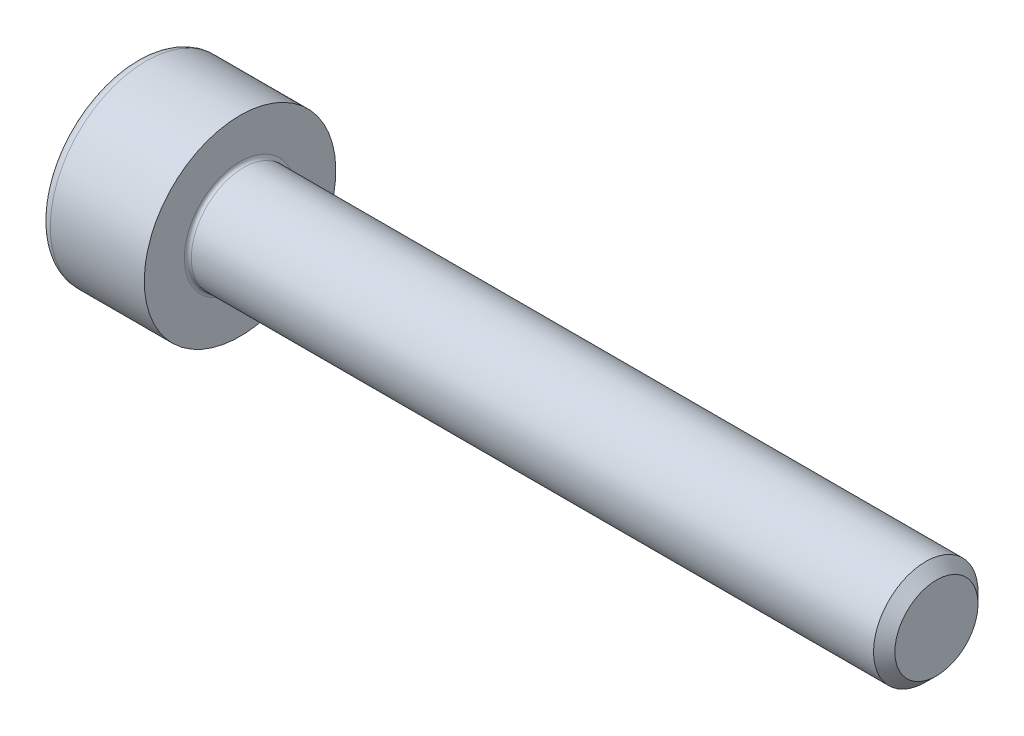
ISO-10303-21;
HEADER;
FILE_DESCRIPTION(('STEP AP214'),'2;1');
FILE_NAME('part.step','',(''),(''),'','','');
FILE_SCHEMA(('AUTOMOTIVE_DESIGN { 1 0 10303 214 1 1 1 1 }'));
ENDSEC;
DATA;
#1=APPLICATION_CONTEXT('core data for automotive mechanical design processes');
#2=APPLICATION_PROTOCOL_DEFINITION('international standard','automotive_design',2000,#1);
#3=PRODUCT_CONTEXT('',#1,'mechanical');
#4=PRODUCT('Part','Part','',(#3));
#5=PRODUCT_RELATED_PRODUCT_CATEGORY('part','',(#4));
#6=PRODUCT_DEFINITION_FORMATION('','',#4);
#7=PRODUCT_DEFINITION_CONTEXT('part definition',#1,'design');
#8=PRODUCT_DEFINITION('design','',#6,#7);
#9=PRODUCT_DEFINITION_SHAPE('','',#8);
#10=(LENGTH_UNIT() NAMED_UNIT(*) SI_UNIT(.MILLI.,.METRE.));
#11=(NAMED_UNIT(*) PLANE_ANGLE_UNIT() SI_UNIT($,.RADIAN.));
#12=(NAMED_UNIT(*) SI_UNIT($,.STERADIAN.) SOLID_ANGLE_UNIT());
#13=UNCERTAINTY_MEASURE_WITH_UNIT(LENGTH_MEASURE(1.E-05),#10,'distance_accuracy_value','');
#14=(GEOMETRIC_REPRESENTATION_CONTEXT(3) GLOBAL_UNCERTAINTY_ASSIGNED_CONTEXT((#13)) GLOBAL_UNIT_ASSIGNED_CONTEXT((#10,
#11,#12)) REPRESENTATION_CONTEXT('',''));
#15=CARTESIAN_POINT('',(0.,0.,0.));
#16=DIRECTION('',(0.,0.,1.));
#17=DIRECTION('',(1.,0.,0.));
#18=AXIS2_PLACEMENT_3D('',#15,#16,#17);
#19=CARTESIAN_POINT('',(-1.70499999995855,0.,0.));
#20=DIRECTION('',(-1.,0.,0.));
#21=DIRECTION('',(0.,0.,1.));
#22=AXIS2_PLACEMENT_3D('',#19,#20,#21);
#23=CONICAL_SURFACE('',#22,1.45203592694543,1.04719755118368);
#24=CARTESIAN_POINT('',(-0.866666666638594,0.,0.));
#25=VERTEX_POINT('',#24);
#26=VERTEX_LOOP('',#25);
#27=FACE_BOUND('',#26,.T.);
#28=CARTESIAN_POINT('',(-1.69999999999703,1.25,0.721687836487888));
#29=CARTESIAN_POINT('',(-1.68168471570057,1.25,0.658260217058919));
#30=CARTESIAN_POINT('',(-1.66502792318348,1.25,0.594285091321345));
#31=CARTESIAN_POINT('',(-1.63595399212002,1.25,0.46522715333814));
#32=CARTESIAN_POINT('',(-1.62354713770574,1.25,0.400142048729171));
#33=CARTESIAN_POINT('',(-1.60423497433511,1.25,0.270778406586236));
#34=CARTESIAN_POINT('',(-1.59720111724166,1.25,0.206519767731085));
#35=CARTESIAN_POINT('',(-1.58880573007492,1.25,0.0777002896402734));
#36=CARTESIAN_POINT('',(-1.58743724622727,1.25,0.0131399183071135));
#37=CARTESIAN_POINT('',(-1.59029143134034,1.25,-0.107484209658902));
#38=CARTESIAN_POINT('',(-1.59381330325391,1.25,-0.16356606692486));
#39=CARTESIAN_POINT('',(-1.604973312943,1.25,-0.275364426450217));
#40=CARTESIAN_POINT('',(-1.61261525922482,1.25,-0.331080542317558));
#41=CARTESIAN_POINT('',(-1.63171864583147,1.25,-0.443109217006952));
#42=CARTESIAN_POINT('',(-1.64326102638181,1.25,-0.499407604241041));
#43=CARTESIAN_POINT('',(-1.66945735052075,1.25,-0.611164931122247));
#44=CARTESIAN_POINT('',(-1.68410514296671,1.25,-0.666625301405443));
#45=CARTESIAN_POINT('',(-1.69999999999703,1.25,-0.72168783648789));
#46=B_SPLINE_CURVE_WITH_KNOTS('',3,(#28,#29,#30,#31,#32,#33,#34,#35,#36,#37,#38,#39,#40,#41,#42,
#43,#44,#45),.UNSPECIFIED.,.F.,.F.,(4,2,2,2,2,2,2,2,4),(0.,0.198135007224076,0.396746135644064,
0.590442253848449,0.783900555564741,0.952317364148294,1.12089012112463,1.29320101405853,
1.46517373344992),.UNSPECIFIED.);
#47=CARTESIAN_POINT('',(-1.69999999999703,1.25000000000037,0.721687836487247));
#48=VERTEX_POINT('',#47);
#49=CARTESIAN_POINT('',(-1.6999999999969,1.25,-0.721687836487461));
#50=VERTEX_POINT('',#49);
#51=EDGE_CURVE('E20',#48,#50,#46,.T.);
#52=ORIENTED_EDGE('',*,*,#51,.T.);
#53=CARTESIAN_POINT('',(-1.69999999999703,1.25000000000074,-0.721687836486606));
#54=CARTESIAN_POINT('',(-1.68168471570057,1.19507007027368,-0.753401646201091));
#55=CARTESIAN_POINT('',(-1.66502792318348,1.13966598617464,-0.785389209069878));
#56=CARTESIAN_POINT('',(-1.63595399212002,1.02789853332115,-0.84991817806148));
#57=CARTESIAN_POINT('',(-1.62354713770574,0.971533179321811,-0.882460730365965));
#58=CARTESIAN_POINT('',(-1.60423497433511,0.85950097889995,-0.947142551437432));
#59=CARTESIAN_POINT('',(-1.59720111724167,0.80385136523878,-0.979271870865007));
#60=CARTESIAN_POINT('',(-1.58880573007492,0.692290424709884,-1.04368160991041));
#61=CARTESIAN_POINT('',(-1.58743724622727,0.636379503057611,-1.07596179557699));
#62=CARTESIAN_POINT('',(-1.59029143134034,0.531915943929697,-1.13627385956));
#63=CARTESIAN_POINT('',(-1.59381330325391,0.483347630845964,-1.16431478819298));
#64=CARTESIAN_POINT('',(-1.604973312943,0.386527411395579,-1.22021396795566));
#65=CARTESIAN_POINT('',(-1.61261525922482,0.338275839654265,-1.24807202588933));
#66=CARTESIAN_POINT('',(-1.63171864583147,0.241256161420947,-1.30408636323403));
#67=CARTESIAN_POINT('',(-1.64326102638182,0.192500327884133,-1.33223555685107));
#68=CARTESIAN_POINT('',(-1.66945735052075,0.0957156437459675,-1.38811422029167));
#69=CARTESIAN_POINT('',(-1.68410514296671,0.0476855541774276,-1.41584440543327));
#70=CARTESIAN_POINT('',(-1.69999999999703,-7.42934727826491E-13,-1.44337567297449));
#71=B_SPLINE_CURVE_WITH_KNOTS('',3,(#53,#54,#55,#56,#57,#58,#59,#60,#61,#62,#63,#64,#65,#66,#67,
#68,#69,#70),.UNSPECIFIED.,.F.,.F.,(4,2,2,2,2,2,2,2,4),(0.,0.198135007224076,0.396746135644064,
0.590442253848448,0.783900555564741,0.952317364148293,1.12089012112463,1.29320101405852,
1.46517373344991),.UNSPECIFIED.);
#72=CARTESIAN_POINT('',(-1.69999999999703,0.,-1.4433756729745));
#73=VERTEX_POINT('',#72);
#74=EDGE_CURVE('E81',#50,#73,#71,.T.);
#75=ORIENTED_EDGE('',*,*,#74,.T.);
#76=CARTESIAN_POINT('',(-1.69999999999703,7.37971043012133E-13,-1.4433756729745));
#77=CARTESIAN_POINT('',(-1.68168471570057,-0.0549299297263209,-1.41166186326001));
#78=CARTESIAN_POINT('',(-1.66502792318348,-0.110334013825364,-1.37967430039122));
#79=CARTESIAN_POINT('',(-1.63595399212002,-0.222101466678856,-1.31514533139962));
#80=CARTESIAN_POINT('',(-1.62354713770574,-0.278466820678191,-1.28260277909514));
#81=CARTESIAN_POINT('',(-1.60423497433511,-0.390499021100053,-1.21792095802367));
#82=CARTESIAN_POINT('',(-1.59720111724167,-0.446148634761223,-1.18579163859609));
#83=CARTESIAN_POINT('',(-1.58880573007492,-0.557709575290119,-1.12138189955069));
#84=CARTESIAN_POINT('',(-1.58743724622727,-0.613620496942393,-1.08910171388411));
#85=CARTESIAN_POINT('',(-1.59029143134035,-0.718084056070307,-1.0287896499011));
#86=CARTESIAN_POINT('',(-1.59381330325391,-0.766652369154039,-1.00074872126812));
#87=CARTESIAN_POINT('',(-1.604973312943,-0.863472588604424,-0.944849541505444));
#88=CARTESIAN_POINT('',(-1.61261525922483,-0.911724160345738,-0.916991483571773));
#89=CARTESIAN_POINT('',(-1.63171864583147,-1.00874383857905,-0.860977146227077));
#90=CARTESIAN_POINT('',(-1.64326102638182,-1.05749967211587,-0.832827952610033));
#91=CARTESIAN_POINT('',(-1.66945735052075,-1.15428435625403,-0.776949289169431));
#92=CARTESIAN_POINT('',(-1.68410514296671,-1.20231444582257,-0.749219104027832));
#93=CARTESIAN_POINT('',(-1.69999999999703,-1.25000000000074,-0.721687836486609));
#94=B_SPLINE_CURVE_WITH_KNOTS('',3,(#76,#77,#78,#79,#80,#81,#82,#83,#84,#85,#86,#87,#88,#89,#90,
#91,#92,#93),.UNSPECIFIED.,.F.,.F.,(4,2,2,2,2,2,2,2,4),(0.,0.198135007224076,0.396746135644065,
0.59044225384845,0.783900555564743,0.952317364148295,1.12089012112463,1.29320101405852,
1.46517373344991),.UNSPECIFIED.);
#95=CARTESIAN_POINT('',(-1.69999999999703,-1.25000000000037,-0.72168783648725));
#96=VERTEX_POINT('',#95);
#97=EDGE_CURVE('E107',#73,#96,#94,.T.);
#98=ORIENTED_EDGE('',*,*,#97,.T.);
#99=CARTESIAN_POINT('',(-1.69999999999703,-1.25,-0.72168783648789));
#100=CARTESIAN_POINT('',(-1.68168471570057,-1.25,-0.658260217058921));
#101=CARTESIAN_POINT('',(-1.66502792318348,-1.25,-0.594285091321346));
#102=CARTESIAN_POINT('',(-1.63595399212002,-1.25,-0.465227153338142));
#103=CARTESIAN_POINT('',(-1.62354713770574,-1.25,-0.400142048729173));
#104=CARTESIAN_POINT('',(-1.60423497433511,-1.25,-0.270778406586237));
#105=CARTESIAN_POINT('',(-1.59720111724167,-1.25,-0.206519767731087));
#106=CARTESIAN_POINT('',(-1.58880573007492,-1.25,-0.0777002896402751));
#107=CARTESIAN_POINT('',(-1.58743724622727,-1.25,-0.0131399183071152));
#108=CARTESIAN_POINT('',(-1.59029143134034,-1.25,0.1074842096589));
#109=CARTESIAN_POINT('',(-1.59381330325391,-1.25,0.163566066924858));
#110=CARTESIAN_POINT('',(-1.604973312943,-1.25,0.275364426450216));
#111=CARTESIAN_POINT('',(-1.61261525922482,-1.25,0.331080542317556));
#112=CARTESIAN_POINT('',(-1.63171864583147,-1.25,0.44310921700695));
#113=CARTESIAN_POINT('',(-1.64326102638181,-1.25,0.499407604241038));
#114=CARTESIAN_POINT('',(-1.66945735052075,-1.25,0.611164931122244));
#115=CARTESIAN_POINT('',(-1.68410514296671,-1.25,0.666625301405441));
#116=CARTESIAN_POINT('',(-1.69999999999703,-1.25,0.721687836487888));
#117=B_SPLINE_CURVE_WITH_KNOTS('',3,(#99,#100,#101,#102,#103,#104,#105,#106,#107,#108,#109,#110,
#111,#112,#113,#114,#115,#116),.UNSPECIFIED.,.F.,.F.,(4,2,2,2,2,2,2,2,4),(0.,0.198135007224076,
0.396746135644065,0.590442253848449,0.783900555564742,0.952317364148295,1.12089012112463,
1.29320101405853,1.46517373344992),.UNSPECIFIED.);
#118=CARTESIAN_POINT('',(-1.69999999999703,-1.25000000000037,0.721687836487246));
#119=VERTEX_POINT('',#118);
#120=EDGE_CURVE('E132',#96,#119,#117,.T.);
#121=ORIENTED_EDGE('',*,*,#120,.T.);
#122=CARTESIAN_POINT('',(-1.69999999999703,-1.25000000000074,0.721687836486605));
#123=CARTESIAN_POINT('',(-1.68168471570057,-1.19507007027368,0.75340164620109));
#124=CARTESIAN_POINT('',(-1.66502792318348,-1.13966598617464,0.785389209069877));
#125=CARTESIAN_POINT('',(-1.63595399212002,-1.02789853332115,0.849918178061479));
#126=CARTESIAN_POINT('',(-1.62354713770574,-0.971533179321813,0.882460730365964));
#127=CARTESIAN_POINT('',(-1.60423497433511,-0.859500978899952,0.947142551437431));
#128=CARTESIAN_POINT('',(-1.59720111724167,-0.803851365238782,0.979271870865006));
#129=CARTESIAN_POINT('',(-1.58880573007492,-0.692290424709886,1.04368160991041));
#130=CARTESIAN_POINT('',(-1.58743724622727,-0.636379503057612,1.07596179557699));
#131=CARTESIAN_POINT('',(-1.59029143134034,-0.531915943929698,1.13627385956));
#132=CARTESIAN_POINT('',(-1.59381330325391,-0.483347630845966,1.16431478819298));
#133=CARTESIAN_POINT('',(-1.604973312943,-0.38652741139558,1.22021396795566));
#134=CARTESIAN_POINT('',(-1.61261525922482,-0.338275839654266,1.24807202588933));
#135=CARTESIAN_POINT('',(-1.63171864583147,-0.241256161420948,1.30408636323402));
#136=CARTESIAN_POINT('',(-1.64326102638182,-0.192500327884134,1.33223555685107));
#137=CARTESIAN_POINT('',(-1.66945735052075,-0.095715643745968,1.38811422029167));
#138=CARTESIAN_POINT('',(-1.68410514296671,-0.0476855541774282,1.41584440543327));
#139=CARTESIAN_POINT('',(-1.69999999999703,7.42500278451778E-13,1.44337567297449));
#140=B_SPLINE_CURVE_WITH_KNOTS('',3,(#122,#123,#124,#125,#126,#127,#128,#129,#130,#131,#132,
#133,#134,#135,#136,#137,#138,#139),.UNSPECIFIED.,.F.,.F.,(4,2,2,2,2,2,2,2,4),(0.,
0.198135007224075,0.396746135644065,0.590442253848449,0.783900555564742,0.952317364148295,
1.12089012112463,1.29320101405853,1.46517373344992),.UNSPECIFIED.);
#141=CARTESIAN_POINT('',(-1.69999999999703,0.,1.4433756729745));
#142=VERTEX_POINT('',#141);
#143=EDGE_CURVE('E141',#119,#142,#140,.T.);
#144=ORIENTED_EDGE('',*,*,#143,.T.);
#145=CARTESIAN_POINT('',(-1.69999999999703,-7.38806721613336E-13,1.4433756729745));
#146=CARTESIAN_POINT('',(-1.68168471570057,0.0549299297263202,1.41166186326001));
#147=CARTESIAN_POINT('',(-1.66502792318348,0.110334013825363,1.37967430039122));
#148=CARTESIAN_POINT('',(-1.63595399212002,0.222101466678855,1.31514533139962));
#149=CARTESIAN_POINT('',(-1.62354713770574,0.27846682067819,1.28260277909514));
#150=CARTESIAN_POINT('',(-1.60423497433511,0.390499021100052,1.21792095802367));
#151=CARTESIAN_POINT('',(-1.59720111724167,0.446148634761222,1.18579163859609));
#152=CARTESIAN_POINT('',(-1.58880573007492,0.557709575290118,1.12138189955069));
#153=CARTESIAN_POINT('',(-1.58743724622727,0.613620496942391,1.08910171388411));
#154=CARTESIAN_POINT('',(-1.59029143134034,0.718084056070306,1.0287896499011));
#155=CARTESIAN_POINT('',(-1.59381330325391,0.766652369154038,1.00074872126812));
#156=CARTESIAN_POINT('',(-1.604973312943,0.863472588604423,0.944849541505442));
#157=CARTESIAN_POINT('',(-1.61261525922482,0.911724160345737,0.916991483571772));
#158=CARTESIAN_POINT('',(-1.63171864583147,1.00874383857905,0.860977146227076));
#159=CARTESIAN_POINT('',(-1.64326102638182,1.05749967211587,0.832827952610031));
#160=CARTESIAN_POINT('',(-1.66945735052075,1.15428435625403,0.776949289169429));
#161=CARTESIAN_POINT('',(-1.68410514296671,1.20231444582257,0.74921910402783));
#162=CARTESIAN_POINT('',(-1.69999999999703,1.25000000000074,0.721687836486607));
#163=B_SPLINE_CURVE_WITH_KNOTS('',3,(#145,#146,#147,#148,#149,#150,#151,#152,#153,#154,#155,
#156,#157,#158,#159,#160,#161,#162),.UNSPECIFIED.,.F.,.F.,(4,2,2,2,2,2,2,2,4),(0.,
0.198135007224076,0.396746135644066,0.59044225384845,0.783900555564744,0.952317364148296,
1.12089012112463,1.29320101405853,1.46517373344991),.UNSPECIFIED.);
#164=EDGE_CURVE('E83',#142,#48,#163,.T.);
#165=ORIENTED_EDGE('',*,*,#164,.T.);
#166=EDGE_LOOP('',(#52,#75,#98,#121,#144,#165));
#167=FACE_BOUND('',#166,.T.);
#168=ADVANCED_FACE('F16',(#27,#167),#23,.F.);
#169=CARTESIAN_POINT('',(-2.99999999999999,1.25,0.721687836487031));
#170=DIRECTION('',(0.,1.,0.));
#171=DIRECTION('',(0.,0.,1.));
#172=AXIS2_PLACEMENT_3D('',#169,#170,#171);
#173=PLANE('',#172);
#174=DIRECTION('',(1.,0.,0.));
#175=VECTOR('',#174,1.);
#176=CARTESIAN_POINT('',(-2.99999999999999,1.25,0.721687836487034));
#177=LINE('',#176,#175);
#178=CARTESIAN_POINT('',(-2.99999999999999,1.25,0.721687836487032));
#179=VERTEX_POINT('',#178);
#180=EDGE_CURVE('E85',#48,#179,#177,.F.);
#181=ORIENTED_EDGE('',*,*,#180,.T.);
#182=DIRECTION('',(0.,0.,1.));
#183=VECTOR('',#182,1.);
#184=CARTESIAN_POINT('',(-2.99999999999999,1.25,0.));
#185=LINE('',#184,#183);
#186=CARTESIAN_POINT('',(-2.99999999999999,1.25,-0.721687836487033));
#187=VERTEX_POINT('',#186);
#188=EDGE_CURVE('E90',#187,#179,#185,.T.);
#189=ORIENTED_EDGE('',*,*,#188,.F.);
#190=DIRECTION('',(1.,0.,0.));
#191=VECTOR('',#190,1.);
#192=CARTESIAN_POINT('',(-2.99999999999999,1.25,-0.721687836487033));
#193=LINE('',#192,#191);
#194=EDGE_CURVE('E88',#187,#50,#193,.T.);
#195=ORIENTED_EDGE('',*,*,#194,.T.);
#196=ORIENTED_EDGE('',*,*,#51,.F.);
#197=EDGE_LOOP('',(#181,#189,#195,#196));
#198=FACE_BOUND('',#197,.T.);
#199=ADVANCED_FACE('F77',(#198),#173,.F.);
#200=CARTESIAN_POINT('',(-2.99999999999999,0.,1.44337567297407));
#201=DIRECTION('',(0.,0.500000000000001,0.866025403784438));
#202=DIRECTION('',(0.,-0.866025403784438,0.500000000000001));
#203=AXIS2_PLACEMENT_3D('',#200,#201,#202);
#204=PLANE('',#203);
#205=DIRECTION('',(1.,0.,0.));
#206=VECTOR('',#205,1.);
#207=CARTESIAN_POINT('',(-2.99999999999999,0.,1.44337567297407));
#208=LINE('',#207,#206);
#209=CARTESIAN_POINT('',(-2.99999999999999,0.,1.44337567297407));
#210=VERTEX_POINT('',#209);
#211=EDGE_CURVE('E146',#142,#210,#208,.F.);
#212=ORIENTED_EDGE('',*,*,#211,.T.);
#213=DIRECTION('',(0.,-0.866025403784437,0.500000000000004));
#214=VECTOR('',#213,1.);
#215=CARTESIAN_POINT('',(-2.99999999999999,1.25,0.721687836487031));
#216=LINE('',#215,#214);
#217=EDGE_CURVE('E96',#179,#210,#216,.T.);
#218=ORIENTED_EDGE('',*,*,#217,.F.);
#219=ORIENTED_EDGE('',*,*,#180,.F.);
#220=ORIENTED_EDGE('',*,*,#164,.F.);
#221=EDGE_LOOP('',(#212,#218,#219,#220));
#222=FACE_BOUND('',#221,.T.);
#223=ADVANCED_FACE('F151',(#222),#204,.F.);
#224=CARTESIAN_POINT('',(-2.99999999999999,-1.25,0.721687836487033));
#225=DIRECTION('',(0.,-0.5,0.866025403784439));
#226=DIRECTION('',(0.,-0.866025403784439,-0.5));
#227=AXIS2_PLACEMENT_3D('',#224,#225,#226);
#228=PLANE('',#227);
#229=DIRECTION('',(1.,0.,0.));
#230=VECTOR('',#229,1.);
#231=CARTESIAN_POINT('',(-2.99999999999999,-1.25,0.721687836487032));
#232=LINE('',#231,#230);
#233=CARTESIAN_POINT('',(-2.99999999999999,-1.25,0.721687836487032));
#234=VERTEX_POINT('',#233);
#235=EDGE_CURVE('E140',#119,#234,#232,.F.);
#236=ORIENTED_EDGE('',*,*,#235,.T.);
#237=DIRECTION('',(0.,-0.866025403784437,-0.500000000000003));
#238=VECTOR('',#237,1.);
#239=CARTESIAN_POINT('',(-2.99999999999999,0.,1.44337567297407));
#240=LINE('',#239,#238);
#241=EDGE_CURVE('E270',#210,#234,#240,.T.);
#242=ORIENTED_EDGE('',*,*,#241,.F.);
#243=ORIENTED_EDGE('',*,*,#211,.F.);
#244=ORIENTED_EDGE('',*,*,#143,.F.);
#245=EDGE_LOOP('',(#236,#242,#243,#244));
#246=FACE_BOUND('',#245,.T.);
#247=ADVANCED_FACE('F128',(#246),#228,.F.);
#248=CARTESIAN_POINT('',(-2.99999999999999,-1.25,-0.721687836487032));
#249=DIRECTION('',(0.,-1.,0.));
#250=DIRECTION('',(1.,0.,0.));
#251=AXIS2_PLACEMENT_3D('',#248,#249,#250);
#252=PLANE('',#251);
#253=DIRECTION('',(1.,0.,0.));
#254=VECTOR('',#253,1.);
#255=CARTESIAN_POINT('',(-2.99999999999999,-1.25,-0.721687836487037));
#256=LINE('',#255,#254);
#257=CARTESIAN_POINT('',(-2.99999999999999,-1.25,-0.721687836487034));
#258=VERTEX_POINT('',#257);
#259=EDGE_CURVE('E139',#96,#258,#256,.F.);
#260=ORIENTED_EDGE('',*,*,#259,.T.);
#261=DIRECTION('',(0.,0.,1.));
#262=VECTOR('',#261,1.);
#263=CARTESIAN_POINT('',(-2.99999999999999,-1.25,0.));
#264=LINE('',#263,#262);
#265=EDGE_CURVE('E265',#234,#258,#264,.F.);
#266=ORIENTED_EDGE('',*,*,#265,.F.);
#267=ORIENTED_EDGE('',*,*,#235,.F.);
#268=ORIENTED_EDGE('',*,*,#120,.F.);
#269=EDGE_LOOP('',(#260,#266,#267,#268));
#270=FACE_BOUND('',#269,.T.);
#271=ADVANCED_FACE('F124',(#270),#252,.F.);
#272=CARTESIAN_POINT('',(-2.99999999999999,0.,-1.44337567297407));
#273=DIRECTION('',(0.,-0.5,-0.866025403784439));
#274=DIRECTION('',(0.,0.866025403784439,-0.5));
#275=AXIS2_PLACEMENT_3D('',#272,#273,#274);
#276=PLANE('',#275);
#277=DIRECTION('',(1.,0.,0.));
#278=VECTOR('',#277,1.);
#279=CARTESIAN_POINT('',(-2.99999999999999,0.,-1.44337567297407));
#280=LINE('',#279,#278);
#281=CARTESIAN_POINT('',(-2.99999999999999,0.,-1.44337567297407));
#282=VERTEX_POINT('',#281);
#283=EDGE_CURVE('E39',#73,#282,#280,.F.);
#284=ORIENTED_EDGE('',*,*,#283,.T.);
#285=DIRECTION('',(0.,0.866025403784437,-0.500000000000003));
#286=VECTOR('',#285,1.);
#287=CARTESIAN_POINT('',(-2.99999999999999,-1.25,-0.721687836487032));
#288=LINE('',#287,#286);
#289=EDGE_CURVE('E260',#258,#282,#288,.T.);
#290=ORIENTED_EDGE('',*,*,#289,.F.);
#291=ORIENTED_EDGE('',*,*,#259,.F.);
#292=ORIENTED_EDGE('',*,*,#97,.F.);
#293=EDGE_LOOP('',(#284,#290,#291,#292));
#294=FACE_BOUND('',#293,.T.);
#295=ADVANCED_FACE('F118',(#294),#276,.F.);
#296=CARTESIAN_POINT('',(-2.99999999999999,1.25,-0.721687836487033));
#297=DIRECTION('',(0.,0.5,-0.866025403784439));
#298=DIRECTION('',(0.,0.866025403784439,0.5));
#299=AXIS2_PLACEMENT_3D('',#296,#297,#298);
#300=PLANE('',#299);
#301=ORIENTED_EDGE('',*,*,#194,.F.);
#302=DIRECTION('',(0.,0.866025403784437,0.500000000000002));
#303=VECTOR('',#302,1.);
#304=CARTESIAN_POINT('',(-2.99999999999999,0.,-1.44337567297407));
#305=LINE('',#304,#303);
#306=EDGE_CURVE('E258',#282,#187,#305,.T.);
#307=ORIENTED_EDGE('',*,*,#306,.F.);
#308=ORIENTED_EDGE('',*,*,#283,.F.);
#309=ORIENTED_EDGE('',*,*,#74,.F.);
#310=EDGE_LOOP('',(#301,#307,#308,#309));
#311=FACE_BOUND('',#310,.T.);
#312=ADVANCED_FACE('F94',(#311),#300,.F.);
#313=CARTESIAN_POINT('',(-2.99999999999999,2.09668783648703,0.));
#314=DIRECTION('',(-1.,0.,0.));
#315=DIRECTION('',(0.,-1.,0.));
#316=AXIS2_PLACEMENT_3D('',#313,#314,#315);
#317=PLANE('',#316);
#318=ORIENTED_EDGE('',*,*,#289,.T.);
#319=ORIENTED_EDGE('',*,*,#306,.T.);
#320=ORIENTED_EDGE('',*,*,#188,.T.);
#321=ORIENTED_EDGE('',*,*,#217,.T.);
#322=ORIENTED_EDGE('',*,*,#241,.T.);
#323=ORIENTED_EDGE('',*,*,#265,.T.);
#324=EDGE_LOOP('',(#318,#319,#320,#321,#322,#323));
#325=FACE_BOUND('',#324,.T.);
#326=CARTESIAN_POINT('',(-2.99999999999999,0.,0.));
#327=DIRECTION('',(1.,0.,0.));
#328=DIRECTION('',(0.,1.,0.));
#329=AXIS2_PLACEMENT_3D('',#326,#327,#328);
#330=CIRCLE('',#329,2.45);
#331=CARTESIAN_POINT('',(-2.99999999999999,2.45,0.));
#332=VERTEX_POINT('',#331);
#333=EDGE_CURVE('E221',#332,#332,#330,.T.);
#334=ORIENTED_EDGE('',*,*,#333,.F.);
#335=EDGE_LOOP('',(#334));
#336=FACE_BOUND('',#335,.T.);
#337=ADVANCED_FACE('F117',(#325,#336),#317,.T.);
#338=CARTESIAN_POINT('',(-2.69999999999999,0.,0.));
#339=DIRECTION('',(1.,0.,0.));
#340=DIRECTION('',(0.,0.,-1.));
#341=AXIS2_PLACEMENT_3D('',#338,#339,#340);
#342=TOROIDAL_SURFACE('',#341,2.45,0.3);
#343=CARTESIAN_POINT('',(-2.69999999999999,0.,0.));
#344=DIRECTION('',(1.,0.,0.));
#345=DIRECTION('',(0.,1.,0.));
#346=AXIS2_PLACEMENT_3D('',#343,#344,#345);
#347=CIRCLE('',#346,2.75);
#348=CARTESIAN_POINT('',(-2.69999999999999,2.75,0.));
#349=VERTEX_POINT('',#348);
#350=EDGE_CURVE('E285',#349,#349,#347,.T.);
#351=ORIENTED_EDGE('',*,*,#350,.F.);
#352=EDGE_LOOP('',(#351));
#353=FACE_BOUND('',#352,.T.);
#354=ORIENTED_EDGE('',*,*,#333,.T.);
#355=EDGE_LOOP('',(#354));
#356=FACE_BOUND('',#355,.T.);
#357=ADVANCED_FACE('F205',(#353,#356),#342,.T.);
#358=CARTESIAN_POINT('',(-1.49999999999999,0.,0.));
#359=DIRECTION('',(1.,0.,0.));
#360=DIRECTION('',(0.,1.,0.));
#361=AXIS2_PLACEMENT_3D('',#358,#359,#360);
#362=CYLINDRICAL_SURFACE('',#361,2.75);
#363=ORIENTED_EDGE('',*,*,#350,.T.);
#364=EDGE_LOOP('',(#363));
#365=FACE_BOUND('',#364,.T.);
#366=CARTESIAN_POINT('',(0.,0.,0.));
#367=DIRECTION('',(1.,0.,0.));
#368=DIRECTION('',(0.,1.,0.));
#369=AXIS2_PLACEMENT_3D('',#366,#367,#368);
#370=CIRCLE('',#369,2.75);
#371=CARTESIAN_POINT('',(0.,2.75,0.));
#372=VERTEX_POINT('',#371);
#373=EDGE_CURVE('E105',#372,#372,#370,.T.);
#374=ORIENTED_EDGE('',*,*,#373,.F.);
#375=EDGE_LOOP('',(#374));
#376=FACE_BOUND('',#375,.T.);
#377=ADVANCED_FACE('F202',(#365,#376),#362,.T.);
#378=CARTESIAN_POINT('',(20.,0.75,0.));
#379=DIRECTION('',(1.,0.,0.));
#380=DIRECTION('',(0.,1.,0.));
#381=AXIS2_PLACEMENT_3D('',#378,#379,#380);
#382=PLANE('',#381);
#383=CARTESIAN_POINT('',(19.9999999999818,0.,0.));
#384=DIRECTION('',(-1.,0.,0.));
#385=DIRECTION('',(0.,0.,1.));
#386=AXIS2_PLACEMENT_3D('',#383,#384,#385);
#387=CIRCLE('',#386,1.19327499999144);
#388=CARTESIAN_POINT('',(19.9999999999818,0.,1.19327499999144));
#389=VERTEX_POINT('',#388);
#390=EDGE_CURVE('E280',#389,#389,#387,.T.);
#391=ORIENTED_EDGE('',*,*,#390,.F.);
#392=EDGE_LOOP('',(#391));
#393=FACE_BOUND('',#392,.T.);
#394=ADVANCED_FACE('F199',(#393),#382,.T.);
#395=CARTESIAN_POINT('',(0.,2.125,0.));
#396=DIRECTION('',(1.,0.,0.));
#397=DIRECTION('',(0.,1.,0.));
#398=AXIS2_PLACEMENT_3D('',#395,#396,#397);
#399=PLANE('',#398);
#400=CARTESIAN_POINT('',(0.,0.,0.));
#401=DIRECTION('',(1.,0.,0.));
#402=DIRECTION('',(0.,1.,0.));
#403=AXIS2_PLACEMENT_3D('',#400,#401,#402);
#404=CIRCLE('',#403,1.6);
#405=CARTESIAN_POINT('',(0.,1.6,0.));
#406=VERTEX_POINT('',#405);
#407=EDGE_CURVE('E186',#406,#406,#404,.F.);
#408=ORIENTED_EDGE('',*,*,#407,.T.);
#409=EDGE_LOOP('',(#408));
#410=FACE_BOUND('',#409,.T.);
#411=ORIENTED_EDGE('',*,*,#373,.T.);
#412=EDGE_LOOP('',(#411));
#413=FACE_BOUND('',#412,.T.);
#414=ADVANCED_FACE('F190',(#410,#413),#399,.T.);
#415=CARTESIAN_POINT('',(19.6932750000087,0.,0.));
#416=DIRECTION('',(-1.,0.,0.));
#417=DIRECTION('',(0.,0.,1.));
#418=AXIS2_PLACEMENT_3D('',#415,#416,#417);
#419=CONICAL_SURFACE('',#418,1.49999999996453,0.785398163397448);
#420=ORIENTED_EDGE('',*,*,#390,.T.);
#421=EDGE_LOOP('',(#420));
#422=FACE_BOUND('',#421,.T.);
#423=CARTESIAN_POINT('',(19.693275,0.,0.));
#424=DIRECTION('',(1.,0.,0.));
#425=DIRECTION('',(0.,1.,0.));
#426=AXIS2_PLACEMENT_3D('',#423,#424,#425);
#427=CIRCLE('',#426,1.5);
#428=CARTESIAN_POINT('',(19.693275,1.5,0.));
#429=VERTEX_POINT('',#428);
#430=EDGE_CURVE('E30',#429,#429,#427,.F.);
#431=ORIENTED_EDGE('',*,*,#430,.F.);
#432=EDGE_LOOP('',(#431));
#433=FACE_BOUND('',#432,.T.);
#434=ADVANCED_FACE('F168',(#422,#433),#419,.T.);
#435=CARTESIAN_POINT('',(0.100000000000002,0.,0.));
#436=DIRECTION('',(1.,0.,0.));
#437=DIRECTION('',(0.,0.,-1.));
#438=AXIS2_PLACEMENT_3D('',#435,#436,#437);
#439=TOROIDAL_SURFACE('',#438,1.6,0.1);
#440=CARTESIAN_POINT('',(0.100000000000003,0.,0.));
#441=DIRECTION('',(1.,0.,0.));
#442=DIRECTION('',(0.,1.,0.));
#443=AXIS2_PLACEMENT_3D('',#440,#441,#442);
#444=CIRCLE('',#443,1.5);
#445=CARTESIAN_POINT('',(0.100000000000003,1.5,0.));
#446=VERTEX_POINT('',#445);
#447=EDGE_CURVE('E11',#446,#446,#444,.T.);
#448=ORIENTED_EDGE('',*,*,#447,.F.);
#449=EDGE_LOOP('',(#448));
#450=FACE_BOUND('',#449,.T.);
#451=ORIENTED_EDGE('',*,*,#407,.F.);
#452=EDGE_LOOP('',(#451));
#453=FACE_BOUND('',#452,.T.);
#454=ADVANCED_FACE('F162',(#450,#453),#439,.F.);
#455=CARTESIAN_POINT('',(10.625,0.,0.));
#456=DIRECTION('',(1.,0.,0.));
#457=DIRECTION('',(0.,1.,0.));
#458=AXIS2_PLACEMENT_3D('',#455,#456,#457);
#459=CYLINDRICAL_SURFACE('',#458,1.5);
#460=ORIENTED_EDGE('',*,*,#447,.T.);
#461=EDGE_LOOP('',(#460));
#462=FACE_BOUND('',#461,.T.);
#463=ORIENTED_EDGE('',*,*,#430,.T.);
#464=EDGE_LOOP('',(#463));
#465=FACE_BOUND('',#464,.T.);
#466=ADVANCED_FACE('F160',(#462,#465),#459,.T.);
#467=CLOSED_SHELL('',(#168,#199,#223,#247,#271,#295,#312,#337,#357,#377,#394,#414,#434,#454,#466));
#468=MANIFOLD_SOLID_BREP('B1',#467);
#469=ADVANCED_BREP_SHAPE_REPRESENTATION('',(#18,#468),#14);
#470=SHAPE_DEFINITION_REPRESENTATION(#9,#469);
ENDSEC;
END-ISO-10303-21;
